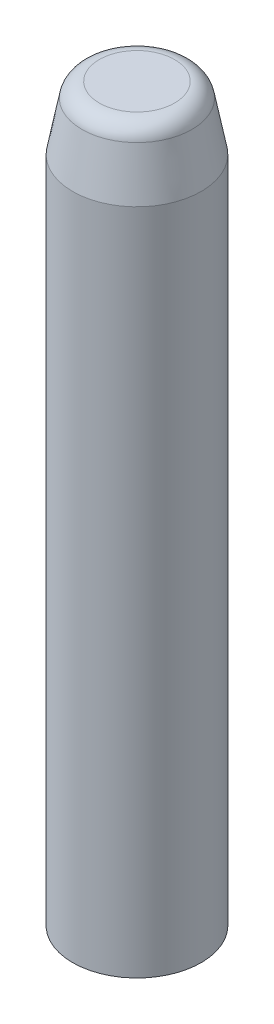
ISO-10303-21;
HEADER;
FILE_DESCRIPTION(('STEP AP214'),'2;1');
FILE_NAME('part.step','',(''),(''),'','','');
FILE_SCHEMA(('AUTOMOTIVE_DESIGN { 1 0 10303 214 1 1 1 1 }'));
ENDSEC;
DATA;
#1=APPLICATION_CONTEXT('core data for automotive mechanical design processes');
#2=APPLICATION_PROTOCOL_DEFINITION('international standard','automotive_design',2000,#1);
#3=PRODUCT_CONTEXT('',#1,'mechanical');
#4=PRODUCT('Part','Part','',(#3));
#5=PRODUCT_RELATED_PRODUCT_CATEGORY('part','',(#4));
#6=PRODUCT_DEFINITION_FORMATION('','',#4);
#7=PRODUCT_DEFINITION_CONTEXT('part definition',#1,'design');
#8=PRODUCT_DEFINITION('design','',#6,#7);
#9=PRODUCT_DEFINITION_SHAPE('','',#8);
#10=(LENGTH_UNIT() NAMED_UNIT(*) SI_UNIT(.MILLI.,.METRE.));
#11=(NAMED_UNIT(*) PLANE_ANGLE_UNIT() SI_UNIT($,.RADIAN.));
#12=(NAMED_UNIT(*) SI_UNIT($,.STERADIAN.) SOLID_ANGLE_UNIT());
#13=UNCERTAINTY_MEASURE_WITH_UNIT(LENGTH_MEASURE(1.E-05),#10,'distance_accuracy_value','');
#14=(GEOMETRIC_REPRESENTATION_CONTEXT(3) GLOBAL_UNCERTAINTY_ASSIGNED_CONTEXT((#13)) GLOBAL_UNIT_ASSIGNED_CONTEXT((#10,
#11,#12)) REPRESENTATION_CONTEXT('',''));
#15=CARTESIAN_POINT('',(0.,0.,0.));
#16=DIRECTION('',(0.,0.,1.));
#17=DIRECTION('',(1.,0.,0.));
#18=AXIS2_PLACEMENT_3D('',#15,#16,#17);
#19=CARTESIAN_POINT('',(0.,0.,0.));
#20=DIRECTION('',(0.,1.,0.));
#21=DIRECTION('',(0.,0.,1.));
#22=AXIS2_PLACEMENT_3D('',#19,#20,#21);
#23=PLANE('',#22);
#24=CARTESIAN_POINT('',(0.,0.,0.));
#25=DIRECTION('',(0.,1.,0.));
#26=DIRECTION('',(0.,0.,1.));
#27=AXIS2_PLACEMENT_3D('',#24,#25,#26);
#28=CIRCLE('',#27,6.4);
#29=CARTESIAN_POINT('',(0.,0.,6.4));
#30=VERTEX_POINT('',#29);
#31=EDGE_CURVE('E10',#30,#30,#28,.T.);
#32=ORIENTED_EDGE('',*,*,#31,.F.);
#33=EDGE_LOOP('',(#32));
#34=FACE_BOUND('',#33,.T.);
#35=CARTESIAN_POINT('',(0.,0.,0.));
#36=DIRECTION('',(0.,1.,0.));
#37=DIRECTION('',(0.,0.,1.));
#38=AXIS2_PLACEMENT_3D('',#35,#36,#37);
#39=CIRCLE('',#38,3.);
#40=CARTESIAN_POINT('',(0.,0.,3.));
#41=VERTEX_POINT('',#40);
#42=EDGE_CURVE('E47',#41,#41,#39,.T.);
#43=ORIENTED_EDGE('',*,*,#42,.T.);
#44=EDGE_LOOP('',(#43));
#45=FACE_BOUND('',#44,.T.);
#46=ADVANCED_FACE('F34',(#34,#45),#23,.F.);
#47=CARTESIAN_POINT('',(0.,65.,0.));
#48=DIRECTION('',(0.,-1.,0.));
#49=DIRECTION('',(0.,0.,-1.));
#50=AXIS2_PLACEMENT_3D('',#47,#48,#49);
#51=CYLINDRICAL_SURFACE('',#50,6.4);
#52=ORIENTED_EDGE('',*,*,#31,.T.);
#53=EDGE_LOOP('',(#52));
#54=FACE_BOUND('',#53,.T.);
#55=CARTESIAN_POINT('',(0.,66.5,0.));
#56=DIRECTION('',(0.,1.,0.));
#57=DIRECTION('',(0.,0.,1.));
#58=AXIS2_PLACEMENT_3D('',#55,#56,#57);
#59=CIRCLE('',#58,6.4);
#60=CARTESIAN_POINT('',(0.,66.5,6.4));
#61=VERTEX_POINT('',#60);
#62=EDGE_CURVE('E56',#61,#61,#59,.T.);
#63=ORIENTED_EDGE('',*,*,#62,.F.);
#64=EDGE_LOOP('',(#63));
#65=FACE_BOUND('',#64,.T.);
#66=ADVANCED_FACE('F36',(#54,#65),#51,.T.);
#67=CARTESIAN_POINT('',(0.,65.,0.));
#68=DIRECTION('',(0.,-1.,0.));
#69=DIRECTION('',(0.,0.,-1.));
#70=AXIS2_PLACEMENT_3D('',#67,#68,#69);
#71=CYLINDRICAL_SURFACE('',#70,3.);
#72=CARTESIAN_POINT('',(0.,65.,0.));
#73=DIRECTION('',(0.,1.,0.));
#74=DIRECTION('',(0.,0.,1.));
#75=AXIS2_PLACEMENT_3D('',#72,#73,#74);
#76=CIRCLE('',#75,3.);
#77=CARTESIAN_POINT('',(0.,65.,3.));
#78=VERTEX_POINT('',#77);
#79=EDGE_CURVE('E51',#78,#78,#76,.T.);
#80=ORIENTED_EDGE('',*,*,#79,.T.);
#81=EDGE_LOOP('',(#80));
#82=FACE_BOUND('',#81,.T.);
#83=ORIENTED_EDGE('',*,*,#42,.F.);
#84=EDGE_LOOP('',(#83));
#85=FACE_BOUND('',#84,.T.);
#86=ADVANCED_FACE('F100',(#82,#85),#71,.F.);
#87=CARTESIAN_POINT('',(0.,65.,0.));
#88=DIRECTION('',(0.,-1.,0.));
#89=DIRECTION('',(0.,0.,-1.));
#90=AXIS2_PLACEMENT_3D('',#87,#88,#89);
#91=PLANE('',#90);
#92=ORIENTED_EDGE('',*,*,#79,.F.);
#93=EDGE_LOOP('',(#92));
#94=FACE_BOUND('',#93,.T.);
#95=ADVANCED_FACE('F78',(#94),#91,.T.);
#96=CARTESIAN_POINT('',(0.,71.3774461888075,0.));
#97=DIRECTION('',(0.,-1.,0.));
#98=DIRECTION('',(0.,0.,-1.));
#99=AXIS2_PLACEMENT_3D('',#96,#97,#98);
#100=CONICAL_SURFACE('',#99,5.47096263070333,0.188221505304772);
#101=CARTESIAN_POINT('',(-0.278034060602046,69.5844299841426,-5.80583458825045));
#102=CARTESIAN_POINT('',(-0.301725131213531,69.6002813914311,-5.80167673084787));
#103=CARTESIAN_POINT('',(-0.324020178622376,69.618140766855,-5.79705681683384));
#104=CARTESIAN_POINT('',(-0.365201972190205,69.6573091444586,-5.78713425263074));
#105=CARTESIAN_POINT('',(-0.384083405901762,69.678623427241,-5.78183055991034));
#106=CARTESIAN_POINT('',(-0.417903424034352,69.7240348554845,-5.77081189304741));
#107=CARTESIAN_POINT('',(-0.4328478309037,69.7481278148342,-5.76509754233752));
#108=CARTESIAN_POINT('',(-0.458446165110209,69.798446322836,-5.75350384882157));
#109=CARTESIAN_POINT('',(-0.469101294095032,69.8246712717299,-5.74762455271964));
#110=CARTESIAN_POINT('',(-0.485973949666367,69.8789650051976,-5.73584419131481));
#111=CARTESIAN_POINT('',(-0.492121782816636,69.90705570867,-5.72994414623613));
#112=CARTESIAN_POINT('',(-0.49952158686284,69.9639348832473,-5.71842855801527));
#113=CARTESIAN_POINT('',(-0.500773265783846,69.992723395862,-5.71281303185967));
#114=CARTESIAN_POINT('',(-0.498308395453095,70.050123276085,-5.7020536664456));
#115=CARTESIAN_POINT('',(-0.494600946796623,70.0787348716457,-5.69690898163086));
#116=CARTESIAN_POINT('',(-0.482292935039211,70.1349900536101,-5.68721045294959));
#117=CARTESIAN_POINT('',(-0.473692813207074,70.1626337270718,-5.68265655584557));
#118=CARTESIAN_POINT('',(-0.451983893421382,70.2156820763789,-5.6742875881374));
#119=CARTESIAN_POINT('',(-0.438949523701512,70.2411155242489,-5.67046185122533));
#120=CARTESIAN_POINT('',(-0.408689781334507,70.289457381764,-5.66349104617078));
#121=CARTESIAN_POINT('',(-0.391464779065109,70.3123660142981,-5.66034591792093));
#122=CARTESIAN_POINT('',(-0.353605223033326,70.3546204059501,-5.65477182862663));
#123=CARTESIAN_POINT('',(-0.333027688615186,70.3740159096687,-5.65233251743255));
#124=CARTESIAN_POINT('',(-0.288861003617005,70.4090897374079,-5.64807208346177));
#125=CARTESIAN_POINT('',(-0.265271986986009,70.4247682266707,-5.64625093320281));
#126=CARTESIAN_POINT('',(-0.215959940971079,70.4518251123679,-5.64319356291931));
#127=CARTESIAN_POINT('',(-0.190255670196642,70.4632371909306,-5.64195274091246));
#128=CARTESIAN_POINT('',(-0.137281677773778,70.4816010416182,-5.63999120859902));
#129=CARTESIAN_POINT('',(-0.110011981337568,70.4885528855562,-5.63927048991836));
#130=CARTESIAN_POINT('',(-0.0547537637296971,70.4977798442445,-5.63831972544569));
#131=CARTESIAN_POINT('',(-0.0267671828402645,70.5000664594844,-5.63808847299304));
#132=CARTESIAN_POINT('',(0.0291944028672586,70.4999305948128,-5.63810230305198));
#133=CARTESIAN_POINT('',(0.0571694077364523,70.4975081359164,-5.63834738343783));
#134=CARTESIAN_POINT('',(0.112302165761069,70.4880269400183,-5.63932504863567));
#135=CARTESIAN_POINT('',(0.139460237182399,70.4809700336527,-5.64005744095786));
#136=CARTESIAN_POINT('',(0.192200124731726,70.4624288238488,-5.64204034032214));
#137=CARTESIAN_POINT('',(0.21778195021623,70.4509445466941,-5.6432908442884));
#138=CARTESIAN_POINT('',(0.266653804272111,70.4238822932288,-5.64635341115175));
#139=CARTESIAN_POINT('',(0.289943080418898,70.408302979026,-5.64816565761084));
#140=CARTESIAN_POINT('',(0.333566008157179,70.373513122409,-5.65239565375053));
#141=CARTESIAN_POINT('',(0.353899670834018,70.3543025936146,-5.65481340116004));
#142=CARTESIAN_POINT('',(0.391091660964849,70.3127715546815,-5.66029277408342));
#143=CARTESIAN_POINT('',(0.407942189553936,70.2904442491367,-5.66335581414474));
#144=CARTESIAN_POINT('',(0.437659821022419,70.2433696132864,-5.67013022268854));
#145=CARTESIAN_POINT('',(0.450526827037792,70.2186222241531,-5.67384160693283));
#146=CARTESIAN_POINT('',(0.472032614379727,70.1672328259996,-5.68191540767006));
#147=CARTESIAN_POINT('',(0.480639210127497,70.140578085563,-5.68628246447395));
#148=CARTESIAN_POINT('',(0.493283699972115,70.0863011008273,-5.69557679699857));
#149=CARTESIAN_POINT('',(0.497321243718105,70.0586787825024,-5.7005041156478));
#150=CARTESIAN_POINT('',(0.500785970391636,70.0028204607684,-5.71088139818856));
#151=CARTESIAN_POINT('',(0.500144157174052,69.9745814199886,-5.716338008261));
#152=CARTESIAN_POINT('',(0.494141816135804,69.9186693255305,-5.72754949300247));
#153=CARTESIAN_POINT('',(0.488780775980466,69.890996333638,-5.73330439999176));
#154=CARTESIAN_POINT('',(0.473376675317683,69.8365091629546,-5.74501066277345));
#155=CARTESIAN_POINT('',(0.463257289877837,69.8097168978827,-5.75096369388845));
#156=CARTESIAN_POINT('',(0.43858698193321,69.7582218687084,-5.76273455689017));
#157=CARTESIAN_POINT('',(0.424035749420607,69.7335192509315,-5.76855237928838));
#158=CARTESIAN_POINT('',(0.390801738990207,69.6867912769269,-5.77982010650562));
#159=CARTESIAN_POINT('',(0.372100194237892,69.6647788094102,-5.78526818845594));
#160=CARTESIAN_POINT('',(0.331094772349142,69.6242241167524,-5.79549680441808));
#161=CARTESIAN_POINT('',(0.30879119004234,69.6056816078603,-5.80027739300509));
#162=CARTESIAN_POINT('',(0.26162123862994,69.5729598016845,-5.80883340909875));
#163=CARTESIAN_POINT('',(0.236808329186811,69.5587078611541,-5.81262540611286));
#164=CARTESIAN_POINT('',(0.184996774306097,69.5346056136761,-5.81909793826393));
#165=CARTESIAN_POINT('',(0.157998691595504,69.5247541777412,-5.82177875847009));
#166=CARTESIAN_POINT('',(0.103534387236605,69.5100508577463,-5.82579876018459));
#167=CARTESIAN_POINT('',(0.0761125787578231,69.5050455624692,-5.8271790698653));
#168=CARTESIAN_POINT('',(0.0207784748829781,69.4996594442411,-5.82866489134118));
#169=CARTESIAN_POINT('',(-0.00713386222529675,69.4992790164909,-5.82877029419392));
#170=CARTESIAN_POINT('',(-0.0619820901316634,69.5031121688382,-5.82771220719457));
#171=CARTESIAN_POINT('',(-0.0889258501738948,69.5072230698332,-5.82657707776686));
#172=CARTESIAN_POINT('',(-0.141697138938172,69.5197337453183,-5.82314861566787));
#173=CARTESIAN_POINT('',(-0.167525935095651,69.5281285030223,-5.82085663780551));
#174=CARTESIAN_POINT('',(-0.207449723878646,69.5447751540196,-5.81636420817446));
#175=CARTESIAN_POINT('',(-0.222126323384394,69.5517563219639,-5.81448981038257));
#176=CARTESIAN_POINT('',(-0.250696472202067,69.5670861416347,-5.8104047294415));
#177=CARTESIAN_POINT('',(-0.264590043159082,69.5754347555362,-5.80819405559417));
#178=CARTESIAN_POINT('',(-0.278034060602046,69.5844299841426,-5.80583458825045));
#179=B_SPLINE_CURVE_WITH_KNOTS('',3,(#101,#102,#103,#104,#105,#106,#107,#108,#109,#110,#111,
#112,#113,#114,#115,#116,#117,#118,#119,#120,#121,#122,#123,#124,#125,#126,#127,#128,#129,#130,
#131,#132,#133,#134,#135,#136,#137,#138,#139,#140,#141,#142,#143,#144,#145,#146,#147,#148,#149,
#150,#151,#152,#153,#154,#155,#156,#157,#158,#159,#160,#161,#162,#163,#164,#165,#166,#167,#168,
#169,#170,#171,#172,#173,#174,#175,#176,#177,#178),.UNSPECIFIED.,.T.,.F.,(4,2,2,2,2,2,2,2,2,2,2,
2,2,2,2,2,2,2,2,2,2,2,2,2,2,2,2,2,2,2,2,2,2,2,2,2,2,2,4),(0.,0.0863584781020034,
0.17285021621365,0.259213314819315,0.345552201806653,0.433199452437718,0.520851929703491,
0.608343774615566,0.695827729913674,0.781910336642923,0.867985337955698,0.952725456719761,
1.0374618076031,1.12151430600301,1.20556545106135,1.28940914583844,1.37325246644626,
1.45706268831428,1.54087241264152,1.62470955260742,1.70854637812501,1.79256893127103,
1.87659352736352,1.96124355831167,2.04590007970945,2.13180734153024,2.21772393087402,
2.30506827469619,2.39241872966135,2.48017251824775,2.56791912775378,2.65408360991625,
2.74022597312634,2.82354238232486,2.90686591096717,2.98832364412117,3.06968620103398,
3.11869356819964,3.16769958000006),.UNSPECIFIED.);
#180=CARTESIAN_POINT('',(-0.278034060602046,69.5844299841426,-5.80583458825045));
#181=VERTEX_POINT('',#180);
#182=EDGE_CURVE('E38',#181,#181,#179,.T.);
#183=ORIENTED_EDGE('',*,*,#182,.F.);
#184=EDGE_LOOP('',(#183));
#185=FACE_BOUND('',#184,.T.);
#186=ORIENTED_EDGE('',*,*,#62,.T.);
#187=EDGE_LOOP('',(#186));
#188=FACE_BOUND('',#187,.T.);
#189=CARTESIAN_POINT('',(0.,71.3774461888075,0.));
#190=DIRECTION('',(0.,1.,0.));
#191=DIRECTION('',(0.,0.,1.));
#192=AXIS2_PLACEMENT_3D('',#189,#190,#191);
#193=CIRCLE('',#192,5.47096263070333);
#194=CARTESIAN_POINT('',(0.,71.3774461888075,5.47096263070333));
#195=VERTEX_POINT('',#194);
#196=EDGE_CURVE('E59',#195,#195,#193,.T.);
#197=ORIENTED_EDGE('',*,*,#196,.F.);
#198=EDGE_LOOP('',(#197));
#199=FACE_BOUND('',#198,.T.);
#200=ADVANCED_FACE('F74',(#185,#188,#199),#100,.T.);
#201=CARTESIAN_POINT('',(0.,71.05,0.));
#202=DIRECTION('',(0.,1.,0.));
#203=DIRECTION('',(0.,0.,1.));
#204=AXIS2_PLACEMENT_3D('',#201,#202,#203);
#205=TOROIDAL_SURFACE('',#204,3.751870139464,1.75);
#206=ORIENTED_EDGE('',*,*,#196,.T.);
#207=EDGE_LOOP('',(#206));
#208=FACE_BOUND('',#207,.T.);
#209=CARTESIAN_POINT('',(0.,72.8,0.));
#210=DIRECTION('',(0.,1.,0.));
#211=DIRECTION('',(0.,0.,1.));
#212=AXIS2_PLACEMENT_3D('',#209,#210,#211);
#213=CIRCLE('',#212,3.75187013946399);
#214=CARTESIAN_POINT('',(0.,72.8,3.75187013946399));
#215=VERTEX_POINT('',#214);
#216=EDGE_CURVE('E62',#215,#215,#213,.T.);
#217=ORIENTED_EDGE('',*,*,#216,.F.);
#218=EDGE_LOOP('',(#217));
#219=FACE_BOUND('',#218,.T.);
#220=ADVANCED_FACE('F77',(#208,#219),#205,.T.);
#221=CARTESIAN_POINT('',(-3.75187013946399,72.8,0.));
#222=DIRECTION('',(0.,1.,0.));
#223=DIRECTION('',(0.,0.,1.));
#224=AXIS2_PLACEMENT_3D('',#221,#222,#223);
#225=PLANE('',#224);
#226=ORIENTED_EDGE('',*,*,#216,.T.);
#227=EDGE_LOOP('',(#226));
#228=FACE_BOUND('',#227,.T.);
#229=ADVANCED_FACE('F85',(#228),#225,.T.);
#230=CARTESIAN_POINT('',(0.,70.,-6.4));
#231=DIRECTION('',(0.,0.,1.));
#232=DIRECTION('',(1.,0.,0.));
#233=AXIS2_PLACEMENT_3D('',#230,#231,#232);
#234=CYLINDRICAL_SURFACE('',#233,0.5);
#235=ORIENTED_EDGE('',*,*,#182,.T.);
#236=EDGE_LOOP('',(#235));
#237=FACE_BOUND('',#236,.T.);
#238=CARTESIAN_POINT('',(0.,70.,0.));
#239=DIRECTION('',(0.,0.,1.));
#240=DIRECTION('',(1.,0.,0.));
#241=AXIS2_PLACEMENT_3D('',#238,#239,#240);
#242=CIRCLE('',#241,0.5);
#243=CARTESIAN_POINT('',(0.5,70.,0.));
#244=VERTEX_POINT('',#243);
#245=EDGE_CURVE('E65',#244,#244,#242,.T.);
#246=ORIENTED_EDGE('',*,*,#245,.T.);
#247=EDGE_LOOP('',(#246));
#248=FACE_BOUND('',#247,.T.);
#249=ADVANCED_FACE('F72',(#237,#248),#234,.F.);
#250=CARTESIAN_POINT('',(0.,70.,0.));
#251=DIRECTION('',(0.,0.,1.));
#252=DIRECTION('',(1.,0.,0.));
#253=AXIS2_PLACEMENT_3D('',#250,#251,#252);
#254=PLANE('',#253);
#255=ORIENTED_EDGE('',*,*,#245,.F.);
#256=EDGE_LOOP('',(#255));
#257=FACE_BOUND('',#256,.T.);
#258=ADVANCED_FACE('F94',(#257),#254,.F.);
#259=CLOSED_SHELL('',(#46,#66,#86,#95,#200,#220,#229,#249,#258));
#260=MANIFOLD_SOLID_BREP('B2',#259);
#261=ADVANCED_BREP_SHAPE_REPRESENTATION('',(#18,#260),#14);
#262=SHAPE_DEFINITION_REPRESENTATION(#9,#261);
ENDSEC;
END-ISO-10303-21;
